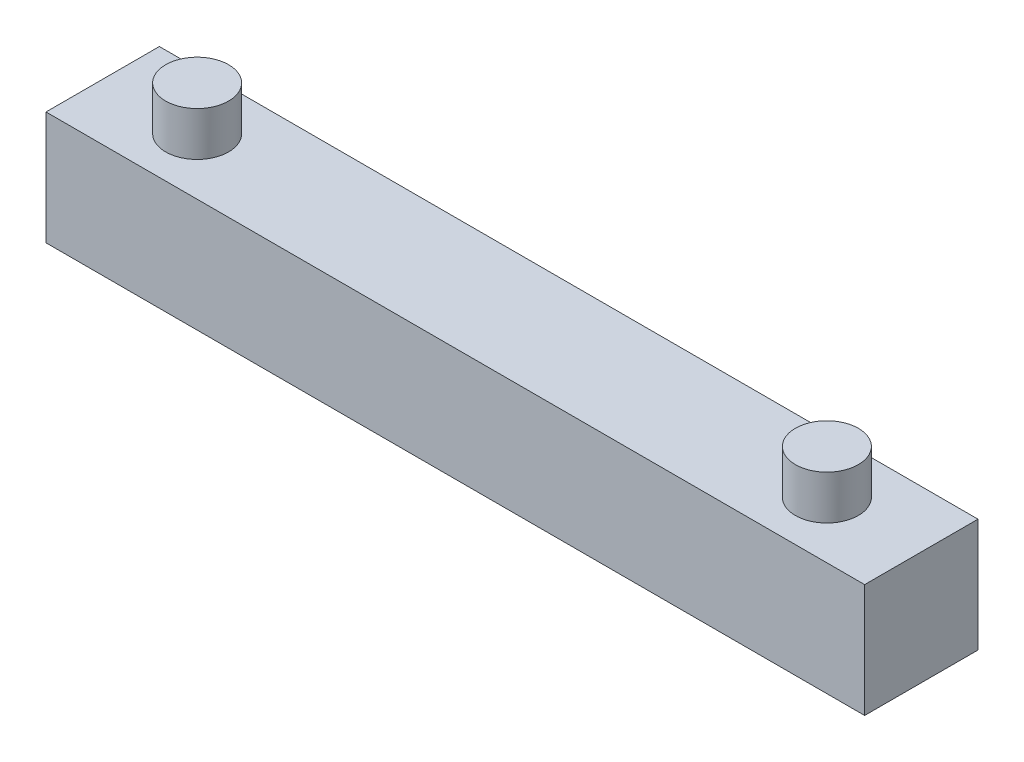
ISO-10303-21;
HEADER;
FILE_DESCRIPTION(('STEP AP214'),'2;1');
FILE_NAME('part.step','',(''),(''),'','','');
FILE_SCHEMA(('AUTOMOTIVE_DESIGN { 1 0 10303 214 1 1 1 1 }'));
ENDSEC;
DATA;
#1=APPLICATION_CONTEXT('core data for automotive mechanical design processes');
#2=APPLICATION_PROTOCOL_DEFINITION('international standard','automotive_design',2000,#1);
#3=PRODUCT_CONTEXT('',#1,'mechanical');
#4=PRODUCT('Part','Part','',(#3));
#5=PRODUCT_RELATED_PRODUCT_CATEGORY('part','',(#4));
#6=PRODUCT_DEFINITION_FORMATION('','',#4);
#7=PRODUCT_DEFINITION_CONTEXT('part definition',#1,'design');
#8=PRODUCT_DEFINITION('design','',#6,#7);
#9=PRODUCT_DEFINITION_SHAPE('','',#8);
#10=(LENGTH_UNIT() NAMED_UNIT(*) SI_UNIT(.MILLI.,.METRE.));
#11=(NAMED_UNIT(*) PLANE_ANGLE_UNIT() SI_UNIT($,.RADIAN.));
#12=(NAMED_UNIT(*) SI_UNIT($,.STERADIAN.) SOLID_ANGLE_UNIT());
#13=UNCERTAINTY_MEASURE_WITH_UNIT(LENGTH_MEASURE(1.E-05),#10,'distance_accuracy_value','');
#14=(GEOMETRIC_REPRESENTATION_CONTEXT(3) GLOBAL_UNCERTAINTY_ASSIGNED_CONTEXT((#13)) GLOBAL_UNIT_ASSIGNED_CONTEXT((#10,
#11,#12)) REPRESENTATION_CONTEXT('',''));
#15=CARTESIAN_POINT('',(0.,0.,0.));
#16=DIRECTION('',(0.,0.,1.));
#17=DIRECTION('',(1.,0.,0.));
#18=AXIS2_PLACEMENT_3D('',#15,#16,#17);
#19=CARTESIAN_POINT('',(0.,9.,9.));
#20=DIRECTION('',(0.,-1.,0.));
#21=DIRECTION('',(0.,0.,-1.));
#22=AXIS2_PLACEMENT_3D('',#19,#20,#21);
#23=PLANE('',#22);
#24=CARTESIAN_POINT('',(57.5,9.,4.5));
#25=DIRECTION('',(0.,-1.,0.));
#26=DIRECTION('',(0.,0.,-1.));
#27=AXIS2_PLACEMENT_3D('',#24,#25,#26);
#28=CIRCLE('',#27,2.49999999999999);
#29=CARTESIAN_POINT('',(57.5,9.,2.));
#30=VERTEX_POINT('',#29);
#31=EDGE_CURVE('E42',#30,#30,#28,.F.);
#32=ORIENTED_EDGE('',*,*,#31,.F.);
#33=EDGE_LOOP('',(#32));
#34=FACE_BOUND('',#33,.T.);
#35=DIRECTION('',(-1.,0.,0.));
#36=VECTOR('',#35,1.);
#37=CARTESIAN_POINT('',(0.,9.,0.));
#38=LINE('',#37,#36);
#39=CARTESIAN_POINT('',(65.,9.,0.));
#40=VERTEX_POINT('',#39);
#41=CARTESIAN_POINT('',(0.,9.,0.));
#42=VERTEX_POINT('',#41);
#43=EDGE_CURVE('E73',#40,#42,#38,.T.);
#44=ORIENTED_EDGE('',*,*,#43,.T.);
#45=DIRECTION('',(0.,0.,-1.));
#46=VECTOR('',#45,1.);
#47=CARTESIAN_POINT('',(0.,9.,9.));
#48=LINE('',#47,#46);
#49=CARTESIAN_POINT('',(0.,9.,9.));
#50=VERTEX_POINT('',#49);
#51=EDGE_CURVE('E97',#50,#42,#48,.T.);
#52=ORIENTED_EDGE('',*,*,#51,.F.);
#53=DIRECTION('',(-1.,0.,0.));
#54=VECTOR('',#53,1.);
#55=CARTESIAN_POINT('',(0.,9.,9.));
#56=LINE('',#55,#54);
#57=CARTESIAN_POINT('',(65.,9.,9.));
#58=VERTEX_POINT('',#57);
#59=EDGE_CURVE('E50',#58,#50,#56,.T.);
#60=ORIENTED_EDGE('',*,*,#59,.F.);
#61=DIRECTION('',(0.,0.,-1.));
#62=VECTOR('',#61,1.);
#63=CARTESIAN_POINT('',(65.,9.,9.));
#64=LINE('',#63,#62);
#65=EDGE_CURVE('E93',#58,#40,#64,.T.);
#66=ORIENTED_EDGE('',*,*,#65,.T.);
#67=EDGE_LOOP('',(#44,#52,#60,#66));
#68=FACE_BOUND('',#67,.T.);
#69=CARTESIAN_POINT('',(7.5,9.,4.5));
#70=DIRECTION('',(0.,-1.,0.));
#71=DIRECTION('',(0.,0.,-1.));
#72=AXIS2_PLACEMENT_3D('',#69,#70,#71);
#73=CIRCLE('',#72,2.5);
#74=CARTESIAN_POINT('',(7.5,9.,2.));
#75=VERTEX_POINT('',#74);
#76=EDGE_CURVE('E11',#75,#75,#73,.F.);
#77=ORIENTED_EDGE('',*,*,#76,.F.);
#78=EDGE_LOOP('',(#77));
#79=FACE_BOUND('',#78,.T.);
#80=ADVANCED_FACE('F33',(#34,#68,#79),#23,.F.);
#81=CARTESIAN_POINT('',(0.,0.,9.));
#82=DIRECTION('',(1.,0.,0.));
#83=DIRECTION('',(0.,0.,-1.));
#84=AXIS2_PLACEMENT_3D('',#81,#82,#83);
#85=PLANE('',#84);
#86=DIRECTION('',(0.,-1.,0.));
#87=VECTOR('',#86,1.);
#88=CARTESIAN_POINT('',(0.,0.,0.));
#89=LINE('',#88,#87);
#90=CARTESIAN_POINT('',(0.,0.,0.));
#91=VERTEX_POINT('',#90);
#92=EDGE_CURVE('E101',#42,#91,#89,.T.);
#93=ORIENTED_EDGE('',*,*,#92,.T.);
#94=DIRECTION('',(0.,0.,-1.));
#95=VECTOR('',#94,1.);
#96=CARTESIAN_POINT('',(0.,0.,9.));
#97=LINE('',#96,#95);
#98=CARTESIAN_POINT('',(0.,0.,9.));
#99=VERTEX_POINT('',#98);
#100=EDGE_CURVE('E92',#99,#91,#97,.T.);
#101=ORIENTED_EDGE('',*,*,#100,.F.);
#102=DIRECTION('',(0.,-1.,0.));
#103=VECTOR('',#102,1.);
#104=CARTESIAN_POINT('',(0.,0.,9.));
#105=LINE('',#104,#103);
#106=EDGE_CURVE('E86',#50,#99,#105,.T.);
#107=ORIENTED_EDGE('',*,*,#106,.F.);
#108=ORIENTED_EDGE('',*,*,#51,.T.);
#109=EDGE_LOOP('',(#93,#101,#107,#108));
#110=FACE_BOUND('',#109,.T.);
#111=ADVANCED_FACE('F35',(#110),#85,.F.);
#112=CARTESIAN_POINT('',(0.,0.,9.));
#113=DIRECTION('',(0.,1.,0.));
#114=DIRECTION('',(0.,0.,1.));
#115=AXIS2_PLACEMENT_3D('',#112,#113,#114);
#116=PLANE('',#115);
#117=DIRECTION('',(1.,0.,0.));
#118=VECTOR('',#117,1.);
#119=CARTESIAN_POINT('',(0.,0.,0.));
#120=LINE('',#119,#118);
#121=CARTESIAN_POINT('',(65.,0.,0.));
#122=VERTEX_POINT('',#121);
#123=EDGE_CURVE('E91',#91,#122,#120,.T.);
#124=ORIENTED_EDGE('',*,*,#123,.T.);
#125=DIRECTION('',(0.,0.,-1.));
#126=VECTOR('',#125,1.);
#127=CARTESIAN_POINT('',(65.,0.,9.));
#128=LINE('',#127,#126);
#129=CARTESIAN_POINT('',(65.,0.,9.));
#130=VERTEX_POINT('',#129);
#131=EDGE_CURVE('E89',#130,#122,#128,.T.);
#132=ORIENTED_EDGE('',*,*,#131,.F.);
#133=DIRECTION('',(1.,0.,0.));
#134=VECTOR('',#133,1.);
#135=CARTESIAN_POINT('',(0.,0.,9.));
#136=LINE('',#135,#134);
#137=EDGE_CURVE('E81',#99,#130,#136,.T.);
#138=ORIENTED_EDGE('',*,*,#137,.F.);
#139=ORIENTED_EDGE('',*,*,#100,.T.);
#140=EDGE_LOOP('',(#124,#132,#138,#139));
#141=FACE_BOUND('',#140,.T.);
#142=ADVANCED_FACE('F90',(#141),#116,.F.);
#143=CARTESIAN_POINT('',(65.,0.,9.));
#144=DIRECTION('',(-1.,0.,0.));
#145=DIRECTION('',(0.,0.,1.));
#146=AXIS2_PLACEMENT_3D('',#143,#144,#145);
#147=PLANE('',#146);
#148=DIRECTION('',(0.,1.,0.));
#149=VECTOR('',#148,1.);
#150=CARTESIAN_POINT('',(65.,0.,0.));
#151=LINE('',#150,#149);
#152=EDGE_CURVE('E67',#122,#40,#151,.T.);
#153=ORIENTED_EDGE('',*,*,#152,.T.);
#154=ORIENTED_EDGE('',*,*,#65,.F.);
#155=DIRECTION('',(0.,1.,0.));
#156=VECTOR('',#155,1.);
#157=CARTESIAN_POINT('',(65.,0.,9.));
#158=LINE('',#157,#156);
#159=EDGE_CURVE('E84',#130,#58,#158,.T.);
#160=ORIENTED_EDGE('',*,*,#159,.F.);
#161=ORIENTED_EDGE('',*,*,#131,.T.);
#162=EDGE_LOOP('',(#153,#154,#160,#161));
#163=FACE_BOUND('',#162,.T.);
#164=ADVANCED_FACE('F95',(#163),#147,.F.);
#165=CARTESIAN_POINT('',(0.,0.,9.));
#166=DIRECTION('',(0.,0.,-1.));
#167=DIRECTION('',(-1.,0.,0.));
#168=AXIS2_PLACEMENT_3D('',#165,#166,#167);
#169=PLANE('',#168);
#170=ORIENTED_EDGE('',*,*,#106,.T.);
#171=ORIENTED_EDGE('',*,*,#137,.T.);
#172=ORIENTED_EDGE('',*,*,#159,.T.);
#173=ORIENTED_EDGE('',*,*,#59,.T.);
#174=EDGE_LOOP('',(#170,#171,#172,#173));
#175=FACE_BOUND('',#174,.T.);
#176=ADVANCED_FACE('F82',(#175),#169,.F.);
#177=CARTESIAN_POINT('',(0.,0.,0.));
#178=DIRECTION('',(0.,0.,-1.));
#179=DIRECTION('',(-1.,0.,0.));
#180=AXIS2_PLACEMENT_3D('',#177,#178,#179);
#181=PLANE('',#180);
#182=ORIENTED_EDGE('',*,*,#92,.F.);
#183=ORIENTED_EDGE('',*,*,#43,.F.);
#184=ORIENTED_EDGE('',*,*,#152,.F.);
#185=ORIENTED_EDGE('',*,*,#123,.F.);
#186=EDGE_LOOP('',(#182,#183,#184,#185));
#187=FACE_BOUND('',#186,.T.);
#188=ADVANCED_FACE('F138',(#187),#181,.T.);
#189=CARTESIAN_POINT('',(57.5,12.5,4.5));
#190=DIRECTION('',(0.,-1.,0.));
#191=DIRECTION('',(0.,0.,-1.));
#192=AXIS2_PLACEMENT_3D('',#189,#190,#191);
#193=CYLINDRICAL_SURFACE('',#192,2.49999999999999);
#194=CARTESIAN_POINT('',(57.5,12.5,4.5));
#195=DIRECTION('',(0.,1.,0.));
#196=DIRECTION('',(0.,0.,1.));
#197=AXIS2_PLACEMENT_3D('',#194,#195,#196);
#198=CIRCLE('',#197,2.49999999999999);
#199=CARTESIAN_POINT('',(57.5,12.5,6.99999999999999));
#200=VERTEX_POINT('',#199);
#201=EDGE_CURVE('E104',#200,#200,#198,.T.);
#202=ORIENTED_EDGE('',*,*,#201,.F.);
#203=EDGE_LOOP('',(#202));
#204=FACE_BOUND('',#203,.T.);
#205=ORIENTED_EDGE('',*,*,#31,.T.);
#206=EDGE_LOOP('',(#205));
#207=FACE_BOUND('',#206,.T.);
#208=ADVANCED_FACE('F113',(#204,#207),#193,.T.);
#209=CARTESIAN_POINT('',(57.5,12.5,4.5));
#210=DIRECTION('',(0.,1.,0.));
#211=DIRECTION('',(0.,0.,1.));
#212=AXIS2_PLACEMENT_3D('',#209,#210,#211);
#213=PLANE('',#212);
#214=ORIENTED_EDGE('',*,*,#201,.T.);
#215=EDGE_LOOP('',(#214));
#216=FACE_BOUND('',#215,.T.);
#217=ADVANCED_FACE('F123',(#216),#213,.T.);
#218=CARTESIAN_POINT('',(7.5,12.5,4.5));
#219=DIRECTION('',(0.,-1.,0.));
#220=DIRECTION('',(0.,0.,-1.));
#221=AXIS2_PLACEMENT_3D('',#218,#219,#220);
#222=CYLINDRICAL_SURFACE('',#221,2.5);
#223=CARTESIAN_POINT('',(7.5,12.5,4.5));
#224=DIRECTION('',(0.,1.,0.));
#225=DIRECTION('',(0.,0.,1.));
#226=AXIS2_PLACEMENT_3D('',#223,#224,#225);
#227=CIRCLE('',#226,2.5);
#228=CARTESIAN_POINT('',(7.5,12.5,7.));
#229=VERTEX_POINT('',#228);
#230=EDGE_CURVE('E157',#229,#229,#227,.T.);
#231=ORIENTED_EDGE('',*,*,#230,.F.);
#232=EDGE_LOOP('',(#231));
#233=FACE_BOUND('',#232,.T.);
#234=ORIENTED_EDGE('',*,*,#76,.T.);
#235=EDGE_LOOP('',(#234));
#236=FACE_BOUND('',#235,.T.);
#237=ADVANCED_FACE('F120',(#233,#236),#222,.T.);
#238=CARTESIAN_POINT('',(7.5,12.5,4.5));
#239=DIRECTION('',(0.,1.,0.));
#240=DIRECTION('',(0.,0.,1.));
#241=AXIS2_PLACEMENT_3D('',#238,#239,#240);
#242=PLANE('',#241);
#243=ORIENTED_EDGE('',*,*,#230,.T.);
#244=EDGE_LOOP('',(#243));
#245=FACE_BOUND('',#244,.T.);
#246=ADVANCED_FACE('F122',(#245),#242,.T.);
#247=CLOSED_SHELL('',(#80,#111,#142,#164,#176,#188,#208,#217,#237,#246));
#248=MANIFOLD_SOLID_BREP('B2',#247);
#249=ADVANCED_BREP_SHAPE_REPRESENTATION('',(#18,#248),#14);
#250=SHAPE_DEFINITION_REPRESENTATION(#9,#249);
ENDSEC;
END-ISO-10303-21;
